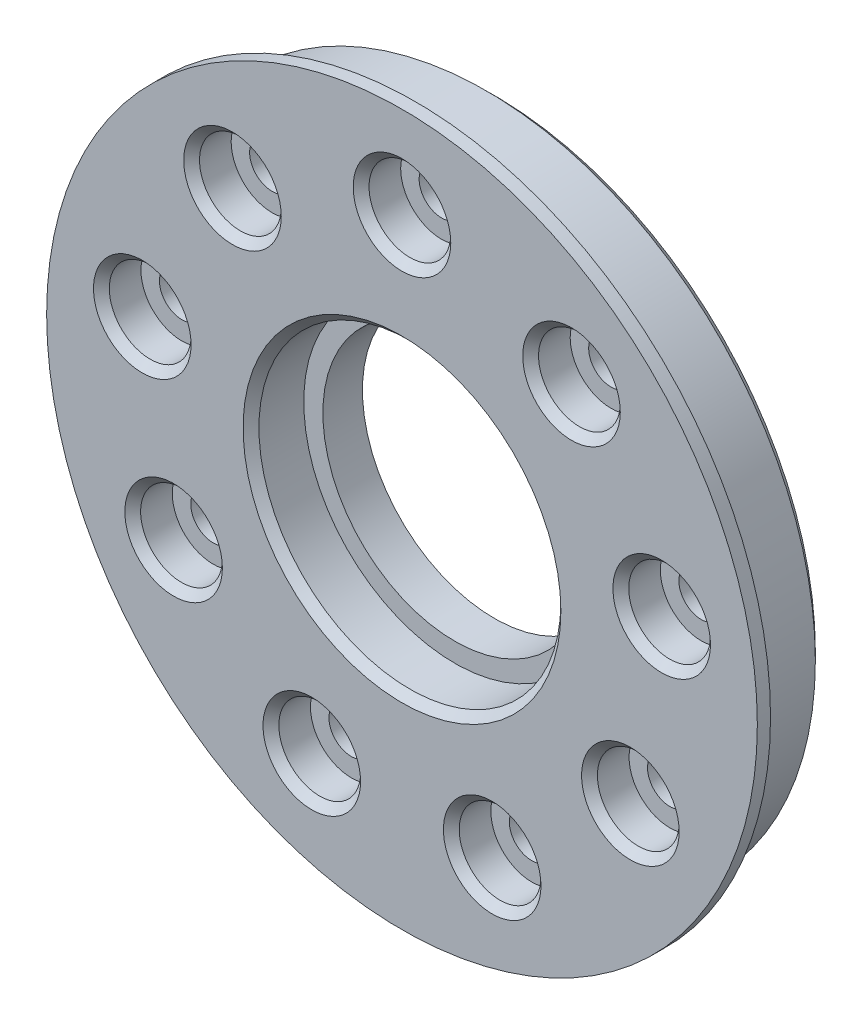
ISO-10303-21;
HEADER;
FILE_DESCRIPTION(('STEP AP214'),'2;1');
FILE_NAME('part.step','',(''),(''),'','','');
FILE_SCHEMA(('AUTOMOTIVE_DESIGN { 1 0 10303 214 1 1 1 1 }'));
ENDSEC;
DATA;
#1=APPLICATION_CONTEXT('core data for automotive mechanical design processes');
#2=APPLICATION_PROTOCOL_DEFINITION('international standard','automotive_design',2000,#1);
#3=PRODUCT_CONTEXT('',#1,'mechanical');
#4=PRODUCT('Part','Part','',(#3));
#5=PRODUCT_RELATED_PRODUCT_CATEGORY('part','',(#4));
#6=PRODUCT_DEFINITION_FORMATION('','',#4);
#7=PRODUCT_DEFINITION_CONTEXT('part definition',#1,'design');
#8=PRODUCT_DEFINITION('design','',#6,#7);
#9=PRODUCT_DEFINITION_SHAPE('','',#8);
#10=(LENGTH_UNIT() NAMED_UNIT(*) SI_UNIT(.MILLI.,.METRE.));
#11=(NAMED_UNIT(*) PLANE_ANGLE_UNIT() SI_UNIT($,.RADIAN.));
#12=(NAMED_UNIT(*) SI_UNIT($,.STERADIAN.) SOLID_ANGLE_UNIT());
#13=UNCERTAINTY_MEASURE_WITH_UNIT(LENGTH_MEASURE(1.E-05),#10,'distance_accuracy_value','');
#14=(GEOMETRIC_REPRESENTATION_CONTEXT(3) GLOBAL_UNCERTAINTY_ASSIGNED_CONTEXT((#13)) GLOBAL_UNIT_ASSIGNED_CONTEXT((#10,
#11,#12)) REPRESENTATION_CONTEXT('',''));
#15=CARTESIAN_POINT('',(0.,0.,0.));
#16=DIRECTION('',(0.,0.,1.));
#17=DIRECTION('',(1.,0.,0.));
#18=AXIS2_PLACEMENT_3D('',#15,#16,#17);
#19=CARTESIAN_POINT('',(0.,0.,6.));
#20=DIRECTION('',(0.,0.,-1.));
#21=DIRECTION('',(-1.,0.,0.));
#22=AXIS2_PLACEMENT_3D('',#19,#20,#21);
#23=CYLINDRICAL_SURFACE('',#22,24.95);
#24=CARTESIAN_POINT('',(0.,0.,0.600000000000003));
#25=DIRECTION('',(0.,0.,1.));
#26=DIRECTION('',(1.,0.,0.));
#27=AXIS2_PLACEMENT_3D('',#24,#25,#26);
#28=CIRCLE('',#27,24.95);
#29=CARTESIAN_POINT('',(24.95,0.,0.600000000000003));
#30=VERTEX_POINT('',#29);
#31=EDGE_CURVE('E38',#30,#30,#28,.T.);
#32=ORIENTED_EDGE('',*,*,#31,.T.);
#33=EDGE_LOOP('',(#32));
#34=FACE_BOUND('',#33,.T.);
#35=CARTESIAN_POINT('',(0.,0.,6.));
#36=DIRECTION('',(0.,0.,1.));
#37=DIRECTION('',(1.,0.,0.));
#38=AXIS2_PLACEMENT_3D('',#35,#36,#37);
#39=CIRCLE('',#38,24.95);
#40=CARTESIAN_POINT('',(24.95,0.,6.));
#41=VERTEX_POINT('',#40);
#42=EDGE_CURVE('E105',#41,#41,#39,.T.);
#43=ORIENTED_EDGE('',*,*,#42,.F.);
#44=EDGE_LOOP('',(#43));
#45=FACE_BOUND('',#44,.T.);
#46=ADVANCED_FACE('F31',(#34,#45),#23,.T.);
#47=CARTESIAN_POINT('',(0.,0.,0.));
#48=DIRECTION('',(0.,0.,1.));
#49=DIRECTION('',(1.,0.,0.));
#50=AXIS2_PLACEMENT_3D('',#47,#48,#49);
#51=PLANE('',#50);
#52=CARTESIAN_POINT('',(0.,0.,0.));
#53=DIRECTION('',(0.,0.,1.));
#54=DIRECTION('',(1.,0.,0.));
#55=AXIS2_PLACEMENT_3D('',#52,#53,#54);
#56=CIRCLE('',#55,24.35);
#57=CARTESIAN_POINT('',(24.35,0.,0.));
#58=VERTEX_POINT('',#57);
#59=EDGE_CURVE('E10',#58,#58,#56,.F.);
#60=ORIENTED_EDGE('',*,*,#59,.T.);
#61=EDGE_LOOP('',(#60));
#62=FACE_BOUND('',#61,.T.);
#63=CARTESIAN_POINT('',(0.,0.,0.));
#64=DIRECTION('',(0.,0.,1.));
#65=DIRECTION('',(1.,0.,0.));
#66=AXIS2_PLACEMENT_3D('',#63,#64,#65);
#67=CIRCLE('',#66,10.);
#68=CARTESIAN_POINT('',(10.,0.,0.));
#69=VERTEX_POINT('',#68);
#70=EDGE_CURVE('E198',#69,#69,#67,.T.);
#71=ORIENTED_EDGE('',*,*,#70,.T.);
#72=EDGE_LOOP('',(#71));
#73=FACE_BOUND('',#72,.T.);
#74=CARTESIAN_POINT('',(-12.855752193731,15.3208888623801,0.));
#75=DIRECTION('',(0.,0.,-1.));
#76=DIRECTION('',(-1.,0.,0.));
#77=AXIS2_PLACEMENT_3D('',#74,#75,#76);
#78=CIRCLE('',#77,1.70000000000006);
#79=CARTESIAN_POINT('',(-14.555752193731,15.3208888623801,0.));
#80=VERTEX_POINT('',#79);
#81=EDGE_CURVE('E131',#80,#80,#78,.T.);
#82=ORIENTED_EDGE('',*,*,#81,.F.);
#83=EDGE_LOOP('',(#82));
#84=FACE_BOUND('',#83,.T.);
#85=CARTESIAN_POINT('',(-19.6961550602449,3.47296355333944,0.));
#86=DIRECTION('',(0.,0.,-1.));
#87=DIRECTION('',(-1.,0.,0.));
#88=AXIS2_PLACEMENT_3D('',#85,#86,#87);
#89=CIRCLE('',#88,1.70000000000048);
#90=CARTESIAN_POINT('',(-21.3961550602453,3.47296355333944,0.));
#91=VERTEX_POINT('',#90);
#92=EDGE_CURVE('E191',#91,#91,#89,.T.);
#93=ORIENTED_EDGE('',*,*,#92,.F.);
#94=EDGE_LOOP('',(#93));
#95=FACE_BOUND('',#94,.T.);
#96=CARTESIAN_POINT('',(-17.3205080756901,-9.99999999999926,0.));
#97=DIRECTION('',(0.,0.,-1.));
#98=DIRECTION('',(-1.,0.,0.));
#99=AXIS2_PLACEMENT_3D('',#96,#97,#98);
#100=CIRCLE('',#99,1.7000000000011);
#101=CARTESIAN_POINT('',(-19.0205080756911,-9.99999999999926,0.));
#102=VERTEX_POINT('',#101);
#103=EDGE_CURVE('E188',#102,#102,#100,.T.);
#104=ORIENTED_EDGE('',*,*,#103,.F.);
#105=EDGE_LOOP('',(#104));
#106=FACE_BOUND('',#105,.T.);
#107=CARTESIAN_POINT('',(-6.84040286651503,-18.7938524157179,0.));
#108=DIRECTION('',(0.,0.,-1.));
#109=DIRECTION('',(-1.,0.,0.));
#110=AXIS2_PLACEMENT_3D('',#107,#108,#109);
#111=CIRCLE('',#110,1.70000000000162);
#112=CARTESIAN_POINT('',(-8.54040286651664,-18.7938524157179,0.));
#113=VERTEX_POINT('',#112);
#114=EDGE_CURVE('E185',#113,#113,#111,.T.);
#115=ORIENTED_EDGE('',*,*,#114,.F.);
#116=EDGE_LOOP('',(#115));
#117=FACE_BOUND('',#116,.T.);
#118=CARTESIAN_POINT('',(6.84040286651173,-18.7938524157185,0.));
#119=DIRECTION('',(0.,0.,-1.));
#120=DIRECTION('',(-1.,0.,0.));
#121=AXIS2_PLACEMENT_3D('',#118,#119,#120);
#122=CIRCLE('',#121,1.7000000000018);
#123=CARTESIAN_POINT('',(5.14040286650992,-18.7938524157185,0.));
#124=VERTEX_POINT('',#123);
#125=EDGE_CURVE('E182',#124,#124,#122,.T.);
#126=ORIENTED_EDGE('',*,*,#125,.F.);
#127=EDGE_LOOP('',(#126));
#128=FACE_BOUND('',#127,.T.);
#129=CARTESIAN_POINT('',(17.3205080756875,-10.0000000000007,0.));
#130=DIRECTION('',(0.,0.,-1.));
#131=DIRECTION('',(-1.,0.,0.));
#132=AXIS2_PLACEMENT_3D('',#129,#130,#131);
#133=CIRCLE('',#132,1.70000000000161);
#134=CARTESIAN_POINT('',(15.6205080756859,-10.0000000000007,0.));
#135=VERTEX_POINT('',#134);
#136=EDGE_CURVE('E179',#135,#135,#133,.T.);
#137=ORIENTED_EDGE('',*,*,#136,.F.);
#138=EDGE_LOOP('',(#137));
#139=FACE_BOUND('',#138,.T.);
#140=CARTESIAN_POINT('',(19.6961550602435,3.47296355333776,0.));
#141=DIRECTION('',(0.,0.,-1.));
#142=DIRECTION('',(-1.,0.,0.));
#143=AXIS2_PLACEMENT_3D('',#140,#141,#142);
#144=CIRCLE('',#143,1.70000000000111);
#145=CARTESIAN_POINT('',(17.9961550602423,3.47296355333776,0.));
#146=VERTEX_POINT('',#145);
#147=EDGE_CURVE('E175',#146,#146,#144,.T.);
#148=ORIENTED_EDGE('',*,*,#147,.F.);
#149=EDGE_LOOP('',(#148));
#150=FACE_BOUND('',#149,.T.);
#151=CARTESIAN_POINT('',(12.8557521937306,15.320888862379,0.));
#152=DIRECTION('',(0.,0.,-1.));
#153=DIRECTION('',(-1.,0.,0.));
#154=AXIS2_PLACEMENT_3D('',#151,#152,#153);
#155=CIRCLE('',#154,1.70000000000059);
#156=CARTESIAN_POINT('',(11.15575219373,15.320888862379,0.));
#157=VERTEX_POINT('',#156);
#158=EDGE_CURVE('E172',#157,#157,#155,.T.);
#159=ORIENTED_EDGE('',*,*,#158,.F.);
#160=EDGE_LOOP('',(#159));
#161=FACE_BOUND('',#160,.T.);
#162=CARTESIAN_POINT('',(0.,20.,0.));
#163=DIRECTION('',(0.,0.,-1.));
#164=DIRECTION('',(-1.,0.,0.));
#165=AXIS2_PLACEMENT_3D('',#162,#163,#164);
#166=CIRCLE('',#165,1.7);
#167=CARTESIAN_POINT('',(-1.7,20.,0.));
#168=VERTEX_POINT('',#167);
#169=EDGE_CURVE('E109',#168,#168,#166,.T.);
#170=ORIENTED_EDGE('',*,*,#169,.F.);
#171=EDGE_LOOP('',(#170));
#172=FACE_BOUND('',#171,.T.);
#173=ADVANCED_FACE('F205',(#62,#73,#84,#95,#106,#117,#128,#139,#150,#161,#172),#51,.F.);
#174=CARTESIAN_POINT('',(0.,0.,7.));
#175=DIRECTION('',(0.,0.,-1.));
#176=DIRECTION('',(-1.,0.,0.));
#177=AXIS2_PLACEMENT_3D('',#174,#175,#176);
#178=CYLINDRICAL_SURFACE('',#177,26.95);
#179=CARTESIAN_POINT('',(0.,0.,7.));
#180=DIRECTION('',(0.,0.,1.));
#181=DIRECTION('',(1.,0.,0.));
#182=AXIS2_PLACEMENT_3D('',#179,#180,#181);
#183=CIRCLE('',#182,26.95);
#184=CARTESIAN_POINT('',(26.95,0.,7.));
#185=VERTEX_POINT('',#184);
#186=EDGE_CURVE('E138',#185,#185,#183,.T.);
#187=ORIENTED_EDGE('',*,*,#186,.F.);
#188=EDGE_LOOP('',(#187));
#189=FACE_BOUND('',#188,.T.);
#190=CARTESIAN_POINT('',(0.,0.,6.));
#191=DIRECTION('',(0.,0.,1.));
#192=DIRECTION('',(1.,0.,0.));
#193=AXIS2_PLACEMENT_3D('',#190,#191,#192);
#194=CIRCLE('',#193,26.95);
#195=CARTESIAN_POINT('',(26.95,0.,6.));
#196=VERTEX_POINT('',#195);
#197=EDGE_CURVE('E139',#196,#196,#194,.T.);
#198=ORIENTED_EDGE('',*,*,#197,.T.);
#199=EDGE_LOOP('',(#198));
#200=FACE_BOUND('',#199,.T.);
#201=ADVANCED_FACE('F239',(#189,#200),#178,.T.);
#202=CARTESIAN_POINT('',(0.,0.,7.));
#203=DIRECTION('',(0.,0.,1.));
#204=DIRECTION('',(1.,0.,0.));
#205=AXIS2_PLACEMENT_3D('',#202,#203,#204);
#206=PLANE('',#205);
#207=CARTESIAN_POINT('',(0.,0.,7.));
#208=DIRECTION('',(0.,0.,1.));
#209=DIRECTION('',(1.,0.,0.));
#210=AXIS2_PLACEMENT_3D('',#207,#208,#209);
#211=CIRCLE('',#210,12.05);
#212=CARTESIAN_POINT('',(12.05,0.,7.));
#213=VERTEX_POINT('',#212);
#214=EDGE_CURVE('E72',#213,#213,#211,.F.);
#215=ORIENTED_EDGE('',*,*,#214,.T.);
#216=EDGE_LOOP('',(#215));
#217=FACE_BOUND('',#216,.T.);
#218=CARTESIAN_POINT('',(-12.8557521937313,15.3208888623808,7.));
#219=DIRECTION('',(0.,0.,1.));
#220=DIRECTION('',(1.,0.,0.));
#221=AXIS2_PLACEMENT_3D('',#218,#219,#220);
#222=CIRCLE('',#221,3.69999999999999);
#223=CARTESIAN_POINT('',(-9.15575219373126,15.3208888623808,7.));
#224=VERTEX_POINT('',#223);
#225=EDGE_CURVE('E75',#224,#224,#222,.F.);
#226=ORIENTED_EDGE('',*,*,#225,.T.);
#227=EDGE_LOOP('',(#226));
#228=FACE_BOUND('',#227,.T.);
#229=CARTESIAN_POINT('',(0.,20.,7.));
#230=DIRECTION('',(0.,0.,1.));
#231=DIRECTION('',(1.,0.,0.));
#232=AXIS2_PLACEMENT_3D('',#229,#230,#231);
#233=CIRCLE('',#232,3.69999999999999);
#234=CARTESIAN_POINT('',(3.69999999999999,20.,7.));
#235=VERTEX_POINT('',#234);
#236=EDGE_CURVE('E78',#235,#235,#233,.F.);
#237=ORIENTED_EDGE('',*,*,#236,.T.);
#238=EDGE_LOOP('',(#237));
#239=FACE_BOUND('',#238,.T.);
#240=CARTESIAN_POINT('',(12.8557521937303,15.3208888623783,7.));
#241=DIRECTION('',(0.,0.,1.));
#242=DIRECTION('',(1.,0.,0.));
#243=AXIS2_PLACEMENT_3D('',#240,#241,#242);
#244=CIRCLE('',#243,3.7);
#245=CARTESIAN_POINT('',(16.5557521937303,15.3208888623783,7.));
#246=VERTEX_POINT('',#245);
#247=EDGE_CURVE('E81',#246,#246,#244,.F.);
#248=ORIENTED_EDGE('',*,*,#247,.T.);
#249=EDGE_LOOP('',(#248));
#250=FACE_BOUND('',#249,.T.);
#251=CARTESIAN_POINT('',(19.6961550602425,3.47296355333664,7.));
#252=DIRECTION('',(0.,0.,1.));
#253=DIRECTION('',(1.,0.,0.));
#254=AXIS2_PLACEMENT_3D('',#251,#252,#253);
#255=CIRCLE('',#254,3.7);
#256=CARTESIAN_POINT('',(23.3961550602425,3.47296355333664,7.));
#257=VERTEX_POINT('',#256);
#258=EDGE_CURVE('E84',#257,#257,#255,.F.);
#259=ORIENTED_EDGE('',*,*,#258,.T.);
#260=EDGE_LOOP('',(#259));
#261=FACE_BOUND('',#260,.T.);
#262=CARTESIAN_POINT('',(17.3205080756858,-10.0000000000017,7.));
#263=DIRECTION('',(0.,0.,1.));
#264=DIRECTION('',(1.,0.,0.));
#265=AXIS2_PLACEMENT_3D('',#262,#263,#264);
#266=CIRCLE('',#265,3.7);
#267=CARTESIAN_POINT('',(21.0205080756858,-10.0000000000017,7.));
#268=VERTEX_POINT('',#267);
#269=EDGE_CURVE('E87',#268,#268,#266,.F.);
#270=ORIENTED_EDGE('',*,*,#269,.T.);
#271=EDGE_LOOP('',(#270));
#272=FACE_BOUND('',#271,.T.);
#273=CARTESIAN_POINT('',(6.84040286650951,-18.7938524157189,7.));
#274=DIRECTION('',(0.,0.,1.));
#275=DIRECTION('',(1.,0.,0.));
#276=AXIS2_PLACEMENT_3D('',#273,#274,#275);
#277=CIRCLE('',#276,3.70000000000001);
#278=CARTESIAN_POINT('',(10.5404028665095,-18.7938524157189,7.));
#279=VERTEX_POINT('',#278);
#280=EDGE_CURVE('E90',#279,#279,#277,.F.);
#281=ORIENTED_EDGE('',*,*,#280,.T.);
#282=EDGE_LOOP('',(#281));
#283=FACE_BOUND('',#282,.T.);
#284=CARTESIAN_POINT('',(-6.84040286651724,-18.7938524157175,7.));
#285=DIRECTION('',(0.,0.,1.));
#286=DIRECTION('',(1.,0.,0.));
#287=AXIS2_PLACEMENT_3D('',#284,#285,#286);
#288=CIRCLE('',#287,3.7);
#289=CARTESIAN_POINT('',(-3.14040286651725,-18.7938524157175,7.));
#290=VERTEX_POINT('',#289);
#291=EDGE_CURVE('E93',#290,#290,#288,.F.);
#292=ORIENTED_EDGE('',*,*,#291,.T.);
#293=EDGE_LOOP('',(#292));
#294=FACE_BOUND('',#293,.T.);
#295=CARTESIAN_POINT('',(-17.3205080756918,-9.99999999999827,7.));
#296=DIRECTION('',(0.,0.,1.));
#297=DIRECTION('',(1.,0.,0.));
#298=AXIS2_PLACEMENT_3D('',#295,#296,#297);
#299=CIRCLE('',#298,3.69999999999999);
#300=CARTESIAN_POINT('',(-13.6205080756918,-9.99999999999827,7.));
#301=VERTEX_POINT('',#300);
#302=EDGE_CURVE('E96',#301,#301,#299,.F.);
#303=ORIENTED_EDGE('',*,*,#302,.T.);
#304=EDGE_LOOP('',(#303));
#305=FACE_BOUND('',#304,.T.);
#306=CARTESIAN_POINT('',(-19.6961550602458,3.47296355334057,7.));
#307=DIRECTION('',(0.,0.,1.));
#308=DIRECTION('',(1.,0.,0.));
#309=AXIS2_PLACEMENT_3D('',#306,#307,#308);
#310=CIRCLE('',#309,3.7);
#311=CARTESIAN_POINT('',(-15.9961550602458,3.47296355334057,7.));
#312=VERTEX_POINT('',#311);
#313=EDGE_CURVE('E99',#312,#312,#310,.F.);
#314=ORIENTED_EDGE('',*,*,#313,.T.);
#315=EDGE_LOOP('',(#314));
#316=FACE_BOUND('',#315,.T.);
#317=ORIENTED_EDGE('',*,*,#186,.T.);
#318=EDGE_LOOP('',(#317));
#319=FACE_BOUND('',#318,.T.);
#320=ADVANCED_FACE('F288',(#217,#228,#239,#250,#261,#272,#283,#294,#305,#316,#319),#206,.T.);
#321=CARTESIAN_POINT('',(0.,0.,6.));
#322=DIRECTION('',(0.,0.,1.));
#323=DIRECTION('',(1.,0.,0.));
#324=AXIS2_PLACEMENT_3D('',#321,#322,#323);
#325=PLANE('',#324);
#326=ORIENTED_EDGE('',*,*,#42,.T.);
#327=EDGE_LOOP('',(#326));
#328=FACE_BOUND('',#327,.T.);
#329=ORIENTED_EDGE('',*,*,#197,.F.);
#330=EDGE_LOOP('',(#329));
#331=FACE_BOUND('',#330,.T.);
#332=ADVANCED_FACE('F291',(#328,#331),#325,.F.);
#333=CARTESIAN_POINT('',(0.,20.,4.));
#334=DIRECTION('',(0.,0.,1.));
#335=DIRECTION('',(1.,0.,0.));
#336=AXIS2_PLACEMENT_3D('',#333,#334,#335);
#337=CYLINDRICAL_SURFACE('',#336,3.1);
#338=CARTESIAN_POINT('',(0.,20.,6.4));
#339=DIRECTION('',(0.,0.,1.));
#340=DIRECTION('',(1.,0.,0.));
#341=AXIS2_PLACEMENT_3D('',#338,#339,#340);
#342=CIRCLE('',#341,3.1);
#343=CARTESIAN_POINT('',(3.1,20.,6.4));
#344=VERTEX_POINT('',#343);
#345=EDGE_CURVE('E66',#344,#344,#342,.T.);
#346=ORIENTED_EDGE('',*,*,#345,.T.);
#347=EDGE_LOOP('',(#346));
#348=FACE_BOUND('',#347,.T.);
#349=CARTESIAN_POINT('',(0.,20.,4.));
#350=DIRECTION('',(0.,0.,-1.));
#351=DIRECTION('',(-1.,0.,0.));
#352=AXIS2_PLACEMENT_3D('',#349,#350,#351);
#353=CIRCLE('',#352,3.1);
#354=CARTESIAN_POINT('',(-3.1,20.,4.));
#355=VERTEX_POINT('',#354);
#356=EDGE_CURVE('E142',#355,#355,#353,.T.);
#357=ORIENTED_EDGE('',*,*,#356,.T.);
#358=EDGE_LOOP('',(#357));
#359=FACE_BOUND('',#358,.T.);
#360=ADVANCED_FACE('F301',(#348,#359),#337,.F.);
#361=CARTESIAN_POINT('',(0.,20.,4.));
#362=DIRECTION('',(0.,0.,-1.));
#363=DIRECTION('',(-1.,0.,0.));
#364=AXIS2_PLACEMENT_3D('',#361,#362,#363);
#365=PLANE('',#364);
#366=CARTESIAN_POINT('',(0.,20.,4.));
#367=DIRECTION('',(0.,0.,-1.));
#368=DIRECTION('',(-1.,0.,0.));
#369=AXIS2_PLACEMENT_3D('',#366,#367,#368);
#370=CIRCLE('',#369,1.7);
#371=CARTESIAN_POINT('',(-1.7,20.,4.));
#372=VERTEX_POINT('',#371);
#373=EDGE_CURVE('E132',#372,#372,#370,.T.);
#374=ORIENTED_EDGE('',*,*,#373,.T.);
#375=EDGE_LOOP('',(#374));
#376=FACE_BOUND('',#375,.T.);
#377=ORIENTED_EDGE('',*,*,#356,.F.);
#378=EDGE_LOOP('',(#377));
#379=FACE_BOUND('',#378,.T.);
#380=ADVANCED_FACE('F309',(#376,#379),#365,.F.);
#381=CARTESIAN_POINT('',(12.8557521937303,15.3208888623783,4.));
#382=DIRECTION('',(0.,0.,1.));
#383=DIRECTION('',(1.,0.,0.));
#384=AXIS2_PLACEMENT_3D('',#381,#382,#383);
#385=CYLINDRICAL_SURFACE('',#384,3.1);
#386=CARTESIAN_POINT('',(12.8557521937303,15.3208888623783,6.40000000000001));
#387=DIRECTION('',(0.,0.,1.));
#388=DIRECTION('',(1.,0.,0.));
#389=AXIS2_PLACEMENT_3D('',#386,#387,#388);
#390=CIRCLE('',#389,3.1);
#391=CARTESIAN_POINT('',(15.9557521937303,15.3208888623783,6.40000000000001));
#392=VERTEX_POINT('',#391);
#393=EDGE_CURVE('E63',#392,#392,#390,.T.);
#394=ORIENTED_EDGE('',*,*,#393,.T.);
#395=EDGE_LOOP('',(#394));
#396=FACE_BOUND('',#395,.T.);
#397=CARTESIAN_POINT('',(12.8557521937303,15.3208888623783,4.));
#398=DIRECTION('',(0.,0.,-1.));
#399=DIRECTION('',(-1.,0.,0.));
#400=AXIS2_PLACEMENT_3D('',#397,#398,#399);
#401=CIRCLE('',#400,3.1);
#402=CARTESIAN_POINT('',(9.75575219373032,15.3208888623783,4.));
#403=VERTEX_POINT('',#402);
#404=EDGE_CURVE('E135',#403,#403,#401,.T.);
#405=ORIENTED_EDGE('',*,*,#404,.T.);
#406=EDGE_LOOP('',(#405));
#407=FACE_BOUND('',#406,.T.);
#408=ADVANCED_FACE('F315',(#396,#407),#385,.F.);
#409=CARTESIAN_POINT('',(12.8557521937303,15.3208888623783,4.));
#410=DIRECTION('',(0.,0.,-1.));
#411=DIRECTION('',(-1.,0.,0.));
#412=AXIS2_PLACEMENT_3D('',#409,#410,#411);
#413=PLANE('',#412);
#414=CARTESIAN_POINT('',(12.8557521937306,15.320888862379,4.));
#415=DIRECTION('',(0.,0.,-1.));
#416=DIRECTION('',(-1.,0.,0.));
#417=AXIS2_PLACEMENT_3D('',#414,#415,#416);
#418=CIRCLE('',#417,1.70000000000059);
#419=CARTESIAN_POINT('',(11.15575219373,15.320888862379,4.));
#420=VERTEX_POINT('',#419);
#421=EDGE_CURVE('E106',#420,#420,#418,.T.);
#422=ORIENTED_EDGE('',*,*,#421,.T.);
#423=EDGE_LOOP('',(#422));
#424=FACE_BOUND('',#423,.T.);
#425=ORIENTED_EDGE('',*,*,#404,.F.);
#426=EDGE_LOOP('',(#425));
#427=FACE_BOUND('',#426,.T.);
#428=ADVANCED_FACE('F319',(#424,#427),#413,.F.);
#429=CARTESIAN_POINT('',(19.6961550602425,3.47296355333664,4.));
#430=DIRECTION('',(0.,0.,1.));
#431=DIRECTION('',(1.,0.,0.));
#432=AXIS2_PLACEMENT_3D('',#429,#430,#431);
#433=CYLINDRICAL_SURFACE('',#432,3.1);
#434=CARTESIAN_POINT('',(19.6961550602425,3.47296355333664,6.4));
#435=DIRECTION('',(0.,0.,1.));
#436=DIRECTION('',(1.,0.,0.));
#437=AXIS2_PLACEMENT_3D('',#434,#435,#436);
#438=CIRCLE('',#437,3.1);
#439=CARTESIAN_POINT('',(22.7961550602425,3.47296355333664,6.4));
#440=VERTEX_POINT('',#439);
#441=EDGE_CURVE('E60',#440,#440,#438,.T.);
#442=ORIENTED_EDGE('',*,*,#441,.T.);
#443=EDGE_LOOP('',(#442));
#444=FACE_BOUND('',#443,.T.);
#445=CARTESIAN_POINT('',(19.6961550602425,3.47296355333664,4.));
#446=DIRECTION('',(0.,0.,-1.));
#447=DIRECTION('',(-1.,0.,0.));
#448=AXIS2_PLACEMENT_3D('',#445,#446,#447);
#449=CIRCLE('',#448,3.1);
#450=CARTESIAN_POINT('',(16.5961550602425,3.47296355333664,4.));
#451=VERTEX_POINT('',#450);
#452=EDGE_CURVE('E150',#451,#451,#449,.T.);
#453=ORIENTED_EDGE('',*,*,#452,.T.);
#454=EDGE_LOOP('',(#453));
#455=FACE_BOUND('',#454,.T.);
#456=ADVANCED_FACE('F323',(#444,#455),#433,.F.);
#457=CARTESIAN_POINT('',(19.6961550602425,3.47296355333664,4.));
#458=DIRECTION('',(0.,0.,-1.));
#459=DIRECTION('',(-1.,0.,0.));
#460=AXIS2_PLACEMENT_3D('',#457,#458,#459);
#461=PLANE('',#460);
#462=CARTESIAN_POINT('',(19.6961550602435,3.47296355333776,4.));
#463=DIRECTION('',(0.,0.,-1.));
#464=DIRECTION('',(-1.,0.,0.));
#465=AXIS2_PLACEMENT_3D('',#462,#463,#464);
#466=CIRCLE('',#465,1.70000000000111);
#467=CARTESIAN_POINT('',(17.9961550602423,3.47296355333776,4.));
#468=VERTEX_POINT('',#467);
#469=EDGE_CURVE('E110',#468,#468,#466,.T.);
#470=ORIENTED_EDGE('',*,*,#469,.T.);
#471=EDGE_LOOP('',(#470));
#472=FACE_BOUND('',#471,.T.);
#473=ORIENTED_EDGE('',*,*,#452,.F.);
#474=EDGE_LOOP('',(#473));
#475=FACE_BOUND('',#474,.T.);
#476=ADVANCED_FACE('F327',(#472,#475),#461,.F.);
#477=CARTESIAN_POINT('',(17.3205080756858,-10.0000000000017,4.));
#478=DIRECTION('',(0.,0.,1.));
#479=DIRECTION('',(1.,0.,0.));
#480=AXIS2_PLACEMENT_3D('',#477,#478,#479);
#481=CYLINDRICAL_SURFACE('',#480,3.1);
#482=CARTESIAN_POINT('',(17.3205080756858,-10.0000000000017,6.4));
#483=DIRECTION('',(0.,0.,1.));
#484=DIRECTION('',(1.,0.,0.));
#485=AXIS2_PLACEMENT_3D('',#482,#483,#484);
#486=CIRCLE('',#485,3.1);
#487=CARTESIAN_POINT('',(20.4205080756858,-10.0000000000017,6.4));
#488=VERTEX_POINT('',#487);
#489=EDGE_CURVE('E57',#488,#488,#486,.T.);
#490=ORIENTED_EDGE('',*,*,#489,.T.);
#491=EDGE_LOOP('',(#490));
#492=FACE_BOUND('',#491,.T.);
#493=CARTESIAN_POINT('',(17.3205080756858,-10.0000000000017,4.));
#494=DIRECTION('',(0.,0.,-1.));
#495=DIRECTION('',(-1.,0.,0.));
#496=AXIS2_PLACEMENT_3D('',#493,#494,#495);
#497=CIRCLE('',#496,3.1);
#498=CARTESIAN_POINT('',(14.2205080756858,-10.0000000000017,4.));
#499=VERTEX_POINT('',#498);
#500=EDGE_CURVE('E153',#499,#499,#497,.T.);
#501=ORIENTED_EDGE('',*,*,#500,.T.);
#502=EDGE_LOOP('',(#501));
#503=FACE_BOUND('',#502,.T.);
#504=ADVANCED_FACE('F331',(#492,#503),#481,.F.);
#505=CARTESIAN_POINT('',(17.3205080756858,-10.0000000000017,4.));
#506=DIRECTION('',(0.,0.,-1.));
#507=DIRECTION('',(-1.,0.,0.));
#508=AXIS2_PLACEMENT_3D('',#505,#506,#507);
#509=PLANE('',#508);
#510=CARTESIAN_POINT('',(17.3205080756875,-10.0000000000007,4.));
#511=DIRECTION('',(0.,0.,-1.));
#512=DIRECTION('',(-1.,0.,0.));
#513=AXIS2_PLACEMENT_3D('',#510,#511,#512);
#514=CIRCLE('',#513,1.70000000000161);
#515=CARTESIAN_POINT('',(15.6205080756859,-10.0000000000007,4.));
#516=VERTEX_POINT('',#515);
#517=EDGE_CURVE('E113',#516,#516,#514,.T.);
#518=ORIENTED_EDGE('',*,*,#517,.T.);
#519=EDGE_LOOP('',(#518));
#520=FACE_BOUND('',#519,.T.);
#521=ORIENTED_EDGE('',*,*,#500,.F.);
#522=EDGE_LOOP('',(#521));
#523=FACE_BOUND('',#522,.T.);
#524=ADVANCED_FACE('F335',(#520,#523),#509,.F.);
#525=CARTESIAN_POINT('',(6.84040286650951,-18.7938524157189,4.));
#526=DIRECTION('',(0.,0.,1.));
#527=DIRECTION('',(1.,0.,0.));
#528=AXIS2_PLACEMENT_3D('',#525,#526,#527);
#529=CYLINDRICAL_SURFACE('',#528,3.1);
#530=CARTESIAN_POINT('',(6.84040286650951,-18.7938524157189,6.39999999999999));
#531=DIRECTION('',(0.,0.,1.));
#532=DIRECTION('',(1.,0.,0.));
#533=AXIS2_PLACEMENT_3D('',#530,#531,#532);
#534=CIRCLE('',#533,3.1);
#535=CARTESIAN_POINT('',(9.94040286650951,-18.7938524157189,6.39999999999999));
#536=VERTEX_POINT('',#535);
#537=EDGE_CURVE('E54',#536,#536,#534,.T.);
#538=ORIENTED_EDGE('',*,*,#537,.T.);
#539=EDGE_LOOP('',(#538));
#540=FACE_BOUND('',#539,.T.);
#541=CARTESIAN_POINT('',(6.84040286650951,-18.7938524157189,4.));
#542=DIRECTION('',(0.,0.,-1.));
#543=DIRECTION('',(-1.,0.,0.));
#544=AXIS2_PLACEMENT_3D('',#541,#542,#543);
#545=CIRCLE('',#544,3.1);
#546=CARTESIAN_POINT('',(3.74040286650951,-18.7938524157189,4.));
#547=VERTEX_POINT('',#546);
#548=EDGE_CURVE('E156',#547,#547,#545,.T.);
#549=ORIENTED_EDGE('',*,*,#548,.T.);
#550=EDGE_LOOP('',(#549));
#551=FACE_BOUND('',#550,.T.);
#552=ADVANCED_FACE('F339',(#540,#551),#529,.F.);
#553=CARTESIAN_POINT('',(6.84040286650951,-18.7938524157189,4.));
#554=DIRECTION('',(0.,0.,-1.));
#555=DIRECTION('',(-1.,0.,0.));
#556=AXIS2_PLACEMENT_3D('',#553,#554,#555);
#557=PLANE('',#556);
#558=CARTESIAN_POINT('',(6.84040286651173,-18.7938524157185,4.));
#559=DIRECTION('',(0.,0.,-1.));
#560=DIRECTION('',(-1.,0.,0.));
#561=AXIS2_PLACEMENT_3D('',#558,#559,#560);
#562=CIRCLE('',#561,1.7000000000018);
#563=CARTESIAN_POINT('',(5.14040286650992,-18.7938524157185,4.));
#564=VERTEX_POINT('',#563);
#565=EDGE_CURVE('E116',#564,#564,#562,.T.);
#566=ORIENTED_EDGE('',*,*,#565,.T.);
#567=EDGE_LOOP('',(#566));
#568=FACE_BOUND('',#567,.T.);
#569=ORIENTED_EDGE('',*,*,#548,.F.);
#570=EDGE_LOOP('',(#569));
#571=FACE_BOUND('',#570,.T.);
#572=ADVANCED_FACE('F343',(#568,#571),#557,.F.);
#573=CARTESIAN_POINT('',(-6.84040286651724,-18.7938524157175,4.));
#574=DIRECTION('',(0.,0.,1.));
#575=DIRECTION('',(1.,0.,0.));
#576=AXIS2_PLACEMENT_3D('',#573,#574,#575);
#577=CYLINDRICAL_SURFACE('',#576,3.1);
#578=CARTESIAN_POINT('',(-6.84040286651724,-18.7938524157175,6.4));
#579=DIRECTION('',(0.,0.,1.));
#580=DIRECTION('',(1.,0.,0.));
#581=AXIS2_PLACEMENT_3D('',#578,#579,#580);
#582=CIRCLE('',#581,3.1);
#583=CARTESIAN_POINT('',(-3.74040286651725,-18.7938524157175,6.4));
#584=VERTEX_POINT('',#583);
#585=EDGE_CURVE('E51',#584,#584,#582,.T.);
#586=ORIENTED_EDGE('',*,*,#585,.T.);
#587=EDGE_LOOP('',(#586));
#588=FACE_BOUND('',#587,.T.);
#589=CARTESIAN_POINT('',(-6.84040286651724,-18.7938524157175,4.));
#590=DIRECTION('',(0.,0.,-1.));
#591=DIRECTION('',(-1.,0.,0.));
#592=AXIS2_PLACEMENT_3D('',#589,#590,#591);
#593=CIRCLE('',#592,3.1);
#594=CARTESIAN_POINT('',(-9.94040286651724,-18.7938524157175,4.));
#595=VERTEX_POINT('',#594);
#596=EDGE_CURVE('E159',#595,#595,#593,.T.);
#597=ORIENTED_EDGE('',*,*,#596,.T.);
#598=EDGE_LOOP('',(#597));
#599=FACE_BOUND('',#598,.T.);
#600=ADVANCED_FACE('F347',(#588,#599),#577,.F.);
#601=CARTESIAN_POINT('',(-6.84040286651724,-18.7938524157175,4.));
#602=DIRECTION('',(0.,0.,-1.));
#603=DIRECTION('',(-1.,0.,0.));
#604=AXIS2_PLACEMENT_3D('',#601,#602,#603);
#605=PLANE('',#604);
#606=CARTESIAN_POINT('',(-6.84040286651503,-18.7938524157179,4.));
#607=DIRECTION('',(0.,0.,-1.));
#608=DIRECTION('',(-1.,0.,0.));
#609=AXIS2_PLACEMENT_3D('',#606,#607,#608);
#610=CIRCLE('',#609,1.70000000000162);
#611=CARTESIAN_POINT('',(-8.54040286651664,-18.7938524157179,4.));
#612=VERTEX_POINT('',#611);
#613=EDGE_CURVE('E119',#612,#612,#610,.T.);
#614=ORIENTED_EDGE('',*,*,#613,.T.);
#615=EDGE_LOOP('',(#614));
#616=FACE_BOUND('',#615,.T.);
#617=ORIENTED_EDGE('',*,*,#596,.F.);
#618=EDGE_LOOP('',(#617));
#619=FACE_BOUND('',#618,.T.);
#620=ADVANCED_FACE('F351',(#616,#619),#605,.F.);
#621=CARTESIAN_POINT('',(-17.3205080756918,-9.99999999999827,4.));
#622=DIRECTION('',(0.,0.,1.));
#623=DIRECTION('',(1.,0.,0.));
#624=AXIS2_PLACEMENT_3D('',#621,#622,#623);
#625=CYLINDRICAL_SURFACE('',#624,3.1);
#626=CARTESIAN_POINT('',(-17.3205080756918,-9.99999999999827,6.4));
#627=DIRECTION('',(0.,0.,1.));
#628=DIRECTION('',(1.,0.,0.));
#629=AXIS2_PLACEMENT_3D('',#626,#627,#628);
#630=CIRCLE('',#629,3.1);
#631=CARTESIAN_POINT('',(-14.2205080756918,-9.99999999999827,6.4));
#632=VERTEX_POINT('',#631);
#633=EDGE_CURVE('E46',#632,#632,#630,.T.);
#634=ORIENTED_EDGE('',*,*,#633,.T.);
#635=EDGE_LOOP('',(#634));
#636=FACE_BOUND('',#635,.T.);
#637=CARTESIAN_POINT('',(-17.3205080756918,-9.99999999999827,4.));
#638=DIRECTION('',(0.,0.,-1.));
#639=DIRECTION('',(-1.,0.,0.));
#640=AXIS2_PLACEMENT_3D('',#637,#638,#639);
#641=CIRCLE('',#640,3.1);
#642=CARTESIAN_POINT('',(-20.4205080756918,-9.99999999999827,4.));
#643=VERTEX_POINT('',#642);
#644=EDGE_CURVE('E162',#643,#643,#641,.T.);
#645=ORIENTED_EDGE('',*,*,#644,.T.);
#646=EDGE_LOOP('',(#645));
#647=FACE_BOUND('',#646,.T.);
#648=ADVANCED_FACE('F355',(#636,#647),#625,.F.);
#649=CARTESIAN_POINT('',(-17.3205080756918,-9.99999999999827,4.));
#650=DIRECTION('',(0.,0.,-1.));
#651=DIRECTION('',(-1.,0.,0.));
#652=AXIS2_PLACEMENT_3D('',#649,#650,#651);
#653=PLANE('',#652);
#654=CARTESIAN_POINT('',(-17.3205080756901,-9.99999999999926,4.));
#655=DIRECTION('',(0.,0.,-1.));
#656=DIRECTION('',(-1.,0.,0.));
#657=AXIS2_PLACEMENT_3D('',#654,#655,#656);
#658=CIRCLE('',#657,1.7000000000011);
#659=CARTESIAN_POINT('',(-19.0205080756911,-9.99999999999926,4.));
#660=VERTEX_POINT('',#659);
#661=EDGE_CURVE('E122',#660,#660,#658,.T.);
#662=ORIENTED_EDGE('',*,*,#661,.T.);
#663=EDGE_LOOP('',(#662));
#664=FACE_BOUND('',#663,.T.);
#665=ORIENTED_EDGE('',*,*,#644,.F.);
#666=EDGE_LOOP('',(#665));
#667=FACE_BOUND('',#666,.T.);
#668=ADVANCED_FACE('F359',(#664,#667),#653,.F.);
#669=CARTESIAN_POINT('',(-19.6961550602458,3.47296355334057,4.));
#670=DIRECTION('',(0.,0.,1.));
#671=DIRECTION('',(1.,0.,0.));
#672=AXIS2_PLACEMENT_3D('',#669,#670,#671);
#673=CYLINDRICAL_SURFACE('',#672,3.1);
#674=CARTESIAN_POINT('',(-19.6961550602458,3.47296355334057,6.4));
#675=DIRECTION('',(0.,0.,1.));
#676=DIRECTION('',(1.,0.,0.));
#677=AXIS2_PLACEMENT_3D('',#674,#675,#676);
#678=CIRCLE('',#677,3.1);
#679=CARTESIAN_POINT('',(-16.5961550602458,3.47296355334057,6.4));
#680=VERTEX_POINT('',#679);
#681=EDGE_CURVE('E42',#680,#680,#678,.T.);
#682=ORIENTED_EDGE('',*,*,#681,.T.);
#683=EDGE_LOOP('',(#682));
#684=FACE_BOUND('',#683,.T.);
#685=CARTESIAN_POINT('',(-19.6961550602458,3.47296355334057,4.));
#686=DIRECTION('',(0.,0.,-1.));
#687=DIRECTION('',(-1.,0.,0.));
#688=AXIS2_PLACEMENT_3D('',#685,#686,#687);
#689=CIRCLE('',#688,3.1);
#690=CARTESIAN_POINT('',(-22.7961550602458,3.47296355334057,4.));
#691=VERTEX_POINT('',#690);
#692=EDGE_CURVE('E165',#691,#691,#689,.T.);
#693=ORIENTED_EDGE('',*,*,#692,.T.);
#694=EDGE_LOOP('',(#693));
#695=FACE_BOUND('',#694,.T.);
#696=ADVANCED_FACE('F363',(#684,#695),#673,.F.);
#697=CARTESIAN_POINT('',(-19.6961550602458,3.47296355334057,4.));
#698=DIRECTION('',(0.,0.,-1.));
#699=DIRECTION('',(-1.,0.,0.));
#700=AXIS2_PLACEMENT_3D('',#697,#698,#699);
#701=PLANE('',#700);
#702=CARTESIAN_POINT('',(-19.6961550602449,3.47296355333944,4.));
#703=DIRECTION('',(0.,0.,-1.));
#704=DIRECTION('',(-1.,0.,0.));
#705=AXIS2_PLACEMENT_3D('',#702,#703,#704);
#706=CIRCLE('',#705,1.70000000000048);
#707=CARTESIAN_POINT('',(-21.3961550602453,3.47296355333944,4.));
#708=VERTEX_POINT('',#707);
#709=EDGE_CURVE('E125',#708,#708,#706,.T.);
#710=ORIENTED_EDGE('',*,*,#709,.T.);
#711=EDGE_LOOP('',(#710));
#712=FACE_BOUND('',#711,.T.);
#713=ORIENTED_EDGE('',*,*,#692,.F.);
#714=EDGE_LOOP('',(#713));
#715=FACE_BOUND('',#714,.T.);
#716=ADVANCED_FACE('F367',(#712,#715),#701,.F.);
#717=CARTESIAN_POINT('',(-12.8557521937313,15.3208888623808,4.));
#718=DIRECTION('',(0.,0.,1.));
#719=DIRECTION('',(1.,0.,0.));
#720=AXIS2_PLACEMENT_3D('',#717,#718,#719);
#721=CYLINDRICAL_SURFACE('',#720,3.1);
#722=CARTESIAN_POINT('',(-12.8557521937313,15.3208888623808,6.4));
#723=DIRECTION('',(0.,0.,1.));
#724=DIRECTION('',(1.,0.,0.));
#725=AXIS2_PLACEMENT_3D('',#722,#723,#724);
#726=CIRCLE('',#725,3.1);
#727=CARTESIAN_POINT('',(-9.75575219373125,15.3208888623808,6.4));
#728=VERTEX_POINT('',#727);
#729=EDGE_CURVE('E69',#728,#728,#726,.T.);
#730=ORIENTED_EDGE('',*,*,#729,.T.);
#731=EDGE_LOOP('',(#730));
#732=FACE_BOUND('',#731,.T.);
#733=CARTESIAN_POINT('',(-12.8557521937313,15.3208888623808,4.));
#734=DIRECTION('',(0.,0.,-1.));
#735=DIRECTION('',(-1.,0.,0.));
#736=AXIS2_PLACEMENT_3D('',#733,#734,#735);
#737=CIRCLE('',#736,3.1);
#738=CARTESIAN_POINT('',(-15.9557521937313,15.3208888623808,4.));
#739=VERTEX_POINT('',#738);
#740=EDGE_CURVE('E147',#739,#739,#737,.T.);
#741=ORIENTED_EDGE('',*,*,#740,.T.);
#742=EDGE_LOOP('',(#741));
#743=FACE_BOUND('',#742,.T.);
#744=ADVANCED_FACE('F371',(#732,#743),#721,.F.);
#745=CARTESIAN_POINT('',(-12.8557521937313,15.3208888623808,4.));
#746=DIRECTION('',(0.,0.,-1.));
#747=DIRECTION('',(-1.,0.,0.));
#748=AXIS2_PLACEMENT_3D('',#745,#746,#747);
#749=PLANE('',#748);
#750=CARTESIAN_POINT('',(-12.855752193731,15.3208888623801,4.));
#751=DIRECTION('',(0.,0.,-1.));
#752=DIRECTION('',(-1.,0.,0.));
#753=AXIS2_PLACEMENT_3D('',#750,#751,#752);
#754=CIRCLE('',#753,1.70000000000006);
#755=CARTESIAN_POINT('',(-14.555752193731,15.3208888623801,4.));
#756=VERTEX_POINT('',#755);
#757=EDGE_CURVE('E128',#756,#756,#754,.T.);
#758=ORIENTED_EDGE('',*,*,#757,.T.);
#759=EDGE_LOOP('',(#758));
#760=FACE_BOUND('',#759,.T.);
#761=ORIENTED_EDGE('',*,*,#740,.F.);
#762=EDGE_LOOP('',(#761));
#763=FACE_BOUND('',#762,.T.);
#764=ADVANCED_FACE('F375',(#760,#763),#749,.F.);
#765=CARTESIAN_POINT('',(0.,20.,7.));
#766=DIRECTION('',(0.,0.,-1.));
#767=DIRECTION('',(-1.,0.,0.));
#768=AXIS2_PLACEMENT_3D('',#765,#766,#767);
#769=CYLINDRICAL_SURFACE('',#768,1.7);
#770=ORIENTED_EDGE('',*,*,#169,.T.);
#771=EDGE_LOOP('',(#770));
#772=FACE_BOUND('',#771,.T.);
#773=ORIENTED_EDGE('',*,*,#373,.F.);
#774=EDGE_LOOP('',(#773));
#775=FACE_BOUND('',#774,.T.);
#776=ADVANCED_FACE('F379',(#772,#775),#769,.F.);
#777=CARTESIAN_POINT('',(-12.855752193731,15.3208888623801,7.));
#778=DIRECTION('',(0.,0.,-1.));
#779=DIRECTION('',(-1.,0.,0.));
#780=AXIS2_PLACEMENT_3D('',#777,#778,#779);
#781=CYLINDRICAL_SURFACE('',#780,1.70000000000006);
#782=ORIENTED_EDGE('',*,*,#81,.T.);
#783=EDGE_LOOP('',(#782));
#784=FACE_BOUND('',#783,.T.);
#785=ORIENTED_EDGE('',*,*,#757,.F.);
#786=EDGE_LOOP('',(#785));
#787=FACE_BOUND('',#786,.T.);
#788=ADVANCED_FACE('F382',(#784,#787),#781,.F.);
#789=CARTESIAN_POINT('',(-19.6961550602449,3.47296355333944,7.));
#790=DIRECTION('',(0.,0.,-1.));
#791=DIRECTION('',(-1.,0.,0.));
#792=AXIS2_PLACEMENT_3D('',#789,#790,#791);
#793=CYLINDRICAL_SURFACE('',#792,1.70000000000048);
#794=ORIENTED_EDGE('',*,*,#92,.T.);
#795=EDGE_LOOP('',(#794));
#796=FACE_BOUND('',#795,.T.);
#797=ORIENTED_EDGE('',*,*,#709,.F.);
#798=EDGE_LOOP('',(#797));
#799=FACE_BOUND('',#798,.T.);
#800=ADVANCED_FACE('F403',(#796,#799),#793,.F.);
#801=CARTESIAN_POINT('',(-17.3205080756901,-9.99999999999926,7.));
#802=DIRECTION('',(0.,0.,-1.));
#803=DIRECTION('',(-1.,0.,0.));
#804=AXIS2_PLACEMENT_3D('',#801,#802,#803);
#805=CYLINDRICAL_SURFACE('',#804,1.7000000000011);
#806=ORIENTED_EDGE('',*,*,#103,.T.);
#807=EDGE_LOOP('',(#806));
#808=FACE_BOUND('',#807,.T.);
#809=ORIENTED_EDGE('',*,*,#661,.F.);
#810=EDGE_LOOP('',(#809));
#811=FACE_BOUND('',#810,.T.);
#812=ADVANCED_FACE('F399',(#808,#811),#805,.F.);
#813=CARTESIAN_POINT('',(-6.84040286651503,-18.7938524157179,7.));
#814=DIRECTION('',(0.,0.,-1.));
#815=DIRECTION('',(-1.,0.,0.));
#816=AXIS2_PLACEMENT_3D('',#813,#814,#815);
#817=CYLINDRICAL_SURFACE('',#816,1.70000000000162);
#818=ORIENTED_EDGE('',*,*,#114,.T.);
#819=EDGE_LOOP('',(#818));
#820=FACE_BOUND('',#819,.T.);
#821=ORIENTED_EDGE('',*,*,#613,.F.);
#822=EDGE_LOOP('',(#821));
#823=FACE_BOUND('',#822,.T.);
#824=ADVANCED_FACE('F395',(#820,#823),#817,.F.);
#825=CARTESIAN_POINT('',(6.84040286651173,-18.7938524157185,7.));
#826=DIRECTION('',(0.,0.,-1.));
#827=DIRECTION('',(-1.,0.,0.));
#828=AXIS2_PLACEMENT_3D('',#825,#826,#827);
#829=CYLINDRICAL_SURFACE('',#828,1.7000000000018);
#830=ORIENTED_EDGE('',*,*,#125,.T.);
#831=EDGE_LOOP('',(#830));
#832=FACE_BOUND('',#831,.T.);
#833=ORIENTED_EDGE('',*,*,#565,.F.);
#834=EDGE_LOOP('',(#833));
#835=FACE_BOUND('',#834,.T.);
#836=ADVANCED_FACE('F391',(#832,#835),#829,.F.);
#837=CARTESIAN_POINT('',(17.3205080756875,-10.0000000000007,7.));
#838=DIRECTION('',(0.,0.,-1.));
#839=DIRECTION('',(-1.,0.,0.));
#840=AXIS2_PLACEMENT_3D('',#837,#838,#839);
#841=CYLINDRICAL_SURFACE('',#840,1.70000000000161);
#842=ORIENTED_EDGE('',*,*,#136,.T.);
#843=EDGE_LOOP('',(#842));
#844=FACE_BOUND('',#843,.T.);
#845=ORIENTED_EDGE('',*,*,#517,.F.);
#846=EDGE_LOOP('',(#845));
#847=FACE_BOUND('',#846,.T.);
#848=ADVANCED_FACE('F387',(#844,#847),#841,.F.);
#849=CARTESIAN_POINT('',(19.6961550602435,3.47296355333776,7.));
#850=DIRECTION('',(0.,0.,-1.));
#851=DIRECTION('',(-1.,0.,0.));
#852=AXIS2_PLACEMENT_3D('',#849,#850,#851);
#853=CYLINDRICAL_SURFACE('',#852,1.70000000000111);
#854=ORIENTED_EDGE('',*,*,#147,.T.);
#855=EDGE_LOOP('',(#854));
#856=FACE_BOUND('',#855,.T.);
#857=ORIENTED_EDGE('',*,*,#469,.F.);
#858=EDGE_LOOP('',(#857));
#859=FACE_BOUND('',#858,.T.);
#860=ADVANCED_FACE('F229',(#856,#859),#853,.F.);
#861=CARTESIAN_POINT('',(12.8557521937306,15.320888862379,7.));
#862=DIRECTION('',(0.,0.,-1.));
#863=DIRECTION('',(-1.,0.,0.));
#864=AXIS2_PLACEMENT_3D('',#861,#862,#863);
#865=CYLINDRICAL_SURFACE('',#864,1.70000000000059);
#866=ORIENTED_EDGE('',*,*,#158,.T.);
#867=EDGE_LOOP('',(#866));
#868=FACE_BOUND('',#867,.T.);
#869=ORIENTED_EDGE('',*,*,#421,.F.);
#870=EDGE_LOOP('',(#869));
#871=FACE_BOUND('',#870,.T.);
#872=ADVANCED_FACE('F223',(#868,#871),#865,.F.);
#873=CARTESIAN_POINT('',(0.,0.,3.));
#874=DIRECTION('',(0.,0.,1.));
#875=DIRECTION('',(1.,0.,0.));
#876=AXIS2_PLACEMENT_3D('',#873,#874,#875);
#877=CYLINDRICAL_SURFACE('',#876,11.45);
#878=CARTESIAN_POINT('',(0.,0.,6.40000000000001));
#879=DIRECTION('',(0.,0.,1.));
#880=DIRECTION('',(1.,0.,0.));
#881=AXIS2_PLACEMENT_3D('',#878,#879,#880);
#882=CIRCLE('',#881,11.45);
#883=CARTESIAN_POINT('',(11.45,0.,6.40000000000001));
#884=VERTEX_POINT('',#883);
#885=EDGE_CURVE('E102',#884,#884,#882,.T.);
#886=ORIENTED_EDGE('',*,*,#885,.T.);
#887=EDGE_LOOP('',(#886));
#888=FACE_BOUND('',#887,.T.);
#889=CARTESIAN_POINT('',(0.,0.,3.));
#890=DIRECTION('',(0.,0.,1.));
#891=DIRECTION('',(1.,0.,0.));
#892=AXIS2_PLACEMENT_3D('',#889,#890,#891);
#893=CIRCLE('',#892,11.45);
#894=CARTESIAN_POINT('',(11.45,0.,3.));
#895=VERTEX_POINT('',#894);
#896=EDGE_CURVE('E176',#895,#895,#893,.T.);
#897=ORIENTED_EDGE('',*,*,#896,.F.);
#898=EDGE_LOOP('',(#897));
#899=FACE_BOUND('',#898,.T.);
#900=ADVANCED_FACE('F218',(#888,#899),#877,.F.);
#901=CARTESIAN_POINT('',(0.,0.,3.));
#902=DIRECTION('',(0.,0.,1.));
#903=DIRECTION('',(1.,0.,0.));
#904=AXIS2_PLACEMENT_3D('',#901,#902,#903);
#905=PLANE('',#904);
#906=CARTESIAN_POINT('',(0.,0.,3.));
#907=DIRECTION('',(0.,0.,1.));
#908=DIRECTION('',(1.,0.,0.));
#909=AXIS2_PLACEMENT_3D('',#906,#907,#908);
#910=CIRCLE('',#909,10.);
#911=CARTESIAN_POINT('',(10.,0.,3.));
#912=VERTEX_POINT('',#911);
#913=EDGE_CURVE('E199',#912,#912,#910,.T.);
#914=ORIENTED_EDGE('',*,*,#913,.F.);
#915=EDGE_LOOP('',(#914));
#916=FACE_BOUND('',#915,.T.);
#917=ORIENTED_EDGE('',*,*,#896,.T.);
#918=EDGE_LOOP('',(#917));
#919=FACE_BOUND('',#918,.T.);
#920=ADVANCED_FACE('F212',(#916,#919),#905,.T.);
#921=CARTESIAN_POINT('',(0.,0.,0.));
#922=DIRECTION('',(0.,0.,1.));
#923=DIRECTION('',(1.,0.,0.));
#924=AXIS2_PLACEMENT_3D('',#921,#922,#923);
#925=CYLINDRICAL_SURFACE('',#924,10.);
#926=ORIENTED_EDGE('',*,*,#70,.F.);
#927=EDGE_LOOP('',(#926));
#928=FACE_BOUND('',#927,.T.);
#929=ORIENTED_EDGE('',*,*,#913,.T.);
#930=EDGE_LOOP('',(#929));
#931=FACE_BOUND('',#930,.T.);
#932=ADVANCED_FACE('F208',(#928,#931),#925,.F.);
#933=CARTESIAN_POINT('',(0.,0.,6.40000000000001));
#934=DIRECTION('',(0.,0.,1.));
#935=DIRECTION('',(1.,0.,0.));
#936=AXIS2_PLACEMENT_3D('',#933,#934,#935);
#937=CONICAL_SURFACE('',#936,11.45,0.785398163397457);
#938=ORIENTED_EDGE('',*,*,#214,.F.);
#939=EDGE_LOOP('',(#938));
#940=FACE_BOUND('',#939,.T.);
#941=ORIENTED_EDGE('',*,*,#885,.F.);
#942=EDGE_LOOP('',(#941));
#943=FACE_BOUND('',#942,.T.);
#944=ADVANCED_FACE('F211',(#940,#943),#937,.F.);
#945=CARTESIAN_POINT('',(-12.8557521937313,15.3208888623808,7.));
#946=DIRECTION('',(0.,0.,1.));
#947=DIRECTION('',(1.,0.,0.));
#948=AXIS2_PLACEMENT_3D('',#945,#946,#947);
#949=CONICAL_SURFACE('',#948,3.69999999999999,0.785398163397442);
#950=ORIENTED_EDGE('',*,*,#729,.F.);
#951=EDGE_LOOP('',(#950));
#952=FACE_BOUND('',#951,.T.);
#953=ORIENTED_EDGE('',*,*,#225,.F.);
#954=EDGE_LOOP('',(#953));
#955=FACE_BOUND('',#954,.T.);
#956=ADVANCED_FACE('F246',(#952,#955),#949,.F.);
#957=CARTESIAN_POINT('',(0.,20.,7.));
#958=DIRECTION('',(0.,0.,1.));
#959=DIRECTION('',(1.,0.,0.));
#960=AXIS2_PLACEMENT_3D('',#957,#958,#959);
#961=CONICAL_SURFACE('',#960,3.69999999999999,0.785398163397447);
#962=ORIENTED_EDGE('',*,*,#345,.F.);
#963=EDGE_LOOP('',(#962));
#964=FACE_BOUND('',#963,.T.);
#965=ORIENTED_EDGE('',*,*,#236,.F.);
#966=EDGE_LOOP('',(#965));
#967=FACE_BOUND('',#966,.T.);
#968=ADVANCED_FACE('F250',(#964,#967),#961,.F.);
#969=CARTESIAN_POINT('',(12.8557521937303,15.3208888623783,7.));
#970=DIRECTION('',(0.,0.,1.));
#971=DIRECTION('',(1.,0.,0.));
#972=AXIS2_PLACEMENT_3D('',#969,#970,#971);
#973=CONICAL_SURFACE('',#972,3.7,0.785398163397452);
#974=ORIENTED_EDGE('',*,*,#393,.F.);
#975=EDGE_LOOP('',(#974));
#976=FACE_BOUND('',#975,.T.);
#977=ORIENTED_EDGE('',*,*,#247,.F.);
#978=EDGE_LOOP('',(#977));
#979=FACE_BOUND('',#978,.T.);
#980=ADVANCED_FACE('F254',(#976,#979),#973,.F.);
#981=CARTESIAN_POINT('',(19.6961550602425,3.47296355333664,7.));
#982=DIRECTION('',(0.,0.,1.));
#983=DIRECTION('',(1.,0.,0.));
#984=AXIS2_PLACEMENT_3D('',#981,#982,#983);
#985=CONICAL_SURFACE('',#984,3.7,0.785398163397452);
#986=ORIENTED_EDGE('',*,*,#441,.F.);
#987=EDGE_LOOP('',(#986));
#988=FACE_BOUND('',#987,.T.);
#989=ORIENTED_EDGE('',*,*,#258,.F.);
#990=EDGE_LOOP('',(#989));
#991=FACE_BOUND('',#990,.T.);
#992=ADVANCED_FACE('F258',(#988,#991),#985,.F.);
#993=CARTESIAN_POINT('',(17.3205080756858,-10.0000000000017,7.));
#994=DIRECTION('',(0.,0.,1.));
#995=DIRECTION('',(1.,0.,0.));
#996=AXIS2_PLACEMENT_3D('',#993,#994,#995);
#997=CONICAL_SURFACE('',#996,3.7,0.785398163397452);
#998=ORIENTED_EDGE('',*,*,#489,.F.);
#999=EDGE_LOOP('',(#998));
#1000=FACE_BOUND('',#999,.T.);
#1001=ORIENTED_EDGE('',*,*,#269,.F.);
#1002=EDGE_LOOP('',(#1001));
#1003=FACE_BOUND('',#1002,.T.);
#1004=ADVANCED_FACE('F262',(#1000,#1003),#997,.F.);
#1005=CARTESIAN_POINT('',(6.84040286650951,-18.7938524157189,7.));
#1006=DIRECTION('',(0.,0.,1.));
#1007=DIRECTION('',(1.,0.,0.));
#1008=AXIS2_PLACEMENT_3D('',#1005,#1006,#1007);
#1009=CONICAL_SURFACE('',#1008,3.70000000000001,0.785398163397448);
#1010=ORIENTED_EDGE('',*,*,#537,.F.);
#1011=EDGE_LOOP('',(#1010));
#1012=FACE_BOUND('',#1011,.T.);
#1013=ORIENTED_EDGE('',*,*,#280,.F.);
#1014=EDGE_LOOP('',(#1013));
#1015=FACE_BOUND('',#1014,.T.);
#1016=ADVANCED_FACE('F266',(#1012,#1015),#1009,.F.);
#1017=CARTESIAN_POINT('',(-6.84040286651724,-18.7938524157175,7.));
#1018=DIRECTION('',(0.,0.,1.));
#1019=DIRECTION('',(1.,0.,0.));
#1020=AXIS2_PLACEMENT_3D('',#1017,#1018,#1019);
#1021=CONICAL_SURFACE('',#1020,3.69999999999999,0.785398163397447);
#1022=ORIENTED_EDGE('',*,*,#585,.F.);
#1023=EDGE_LOOP('',(#1022));
#1024=FACE_BOUND('',#1023,.T.);
#1025=ORIENTED_EDGE('',*,*,#291,.F.);
#1026=EDGE_LOOP('',(#1025));
#1027=FACE_BOUND('',#1026,.T.);
#1028=ADVANCED_FACE('F270',(#1024,#1027),#1021,.F.);
#1029=CARTESIAN_POINT('',(-17.3205080756918,-9.99999999999827,7.));
#1030=DIRECTION('',(0.,0.,1.));
#1031=DIRECTION('',(1.,0.,0.));
#1032=AXIS2_PLACEMENT_3D('',#1029,#1030,#1031);
#1033=CONICAL_SURFACE('',#1032,3.69999999999999,0.785398163397442);
#1034=ORIENTED_EDGE('',*,*,#633,.F.);
#1035=EDGE_LOOP('',(#1034));
#1036=FACE_BOUND('',#1035,.T.);
#1037=ORIENTED_EDGE('',*,*,#302,.F.);
#1038=EDGE_LOOP('',(#1037));
#1039=FACE_BOUND('',#1038,.T.);
#1040=ADVANCED_FACE('F274',(#1036,#1039),#1033,.F.);
#1041=CARTESIAN_POINT('',(-19.6961550602458,3.47296355334057,7.));
#1042=DIRECTION('',(0.,0.,1.));
#1043=DIRECTION('',(1.,0.,0.));
#1044=AXIS2_PLACEMENT_3D('',#1041,#1042,#1043);
#1045=CONICAL_SURFACE('',#1044,3.7,0.785398163397452);
#1046=ORIENTED_EDGE('',*,*,#681,.F.);
#1047=EDGE_LOOP('',(#1046));
#1048=FACE_BOUND('',#1047,.T.);
#1049=ORIENTED_EDGE('',*,*,#313,.F.);
#1050=EDGE_LOOP('',(#1049));
#1051=FACE_BOUND('',#1050,.T.);
#1052=ADVANCED_FACE('F277',(#1048,#1051),#1045,.F.);
#1053=CARTESIAN_POINT('',(0.,0.,0.600000000000003));
#1054=DIRECTION('',(0.,0.,1.));
#1055=DIRECTION('',(1.,0.,0.));
#1056=AXIS2_PLACEMENT_3D('',#1053,#1054,#1055);
#1057=CONICAL_SURFACE('',#1056,24.95,0.785398163397448);
#1058=ORIENTED_EDGE('',*,*,#59,.F.);
#1059=EDGE_LOOP('',(#1058));
#1060=FACE_BOUND('',#1059,.T.);
#1061=ORIENTED_EDGE('',*,*,#31,.F.);
#1062=EDGE_LOOP('',(#1061));
#1063=FACE_BOUND('',#1062,.T.);
#1064=ADVANCED_FACE('F33',(#1060,#1063),#1057,.T.);
#1065=CLOSED_SHELL('',(#46,#173,#201,#320,#332,#360,#380,#408,#428,#456,#476,#504,#524,#552,
#572,#600,#620,#648,#668,#696,#716,#744,#764,#776,#788,#800,#812,#824,#836,#848,#860,#872,#900,
#920,#932,#944,#956,#968,#980,#992,#1004,#1016,#1028,#1040,#1052,#1064));
#1066=MANIFOLD_SOLID_BREP('B2',#1065);
#1067=ADVANCED_BREP_SHAPE_REPRESENTATION('',(#18,#1066),#14);
#1068=SHAPE_DEFINITION_REPRESENTATION(#9,#1067);
ENDSEC;
END-ISO-10303-21;
